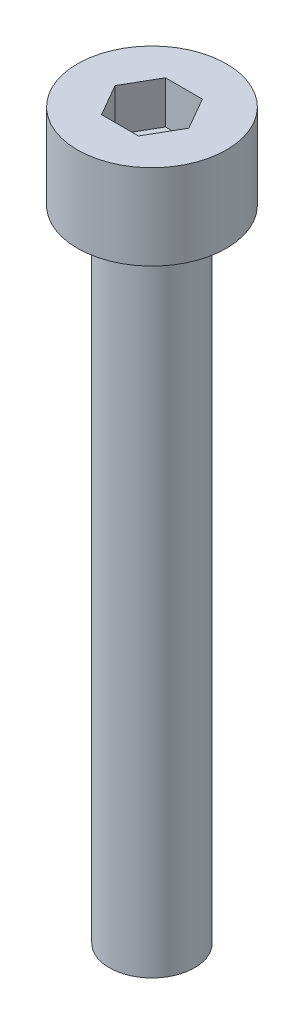
ISO-10303-21;
HEADER;
FILE_DESCRIPTION(('STEP AP214'),'2;1');
FILE_NAME('part.step','',(''),(''),'','','');
FILE_SCHEMA(('AUTOMOTIVE_DESIGN { 1 0 10303 214 1 1 1 1 }'));
ENDSEC;
DATA;
#1=APPLICATION_CONTEXT('core data for automotive mechanical design processes');
#2=APPLICATION_PROTOCOL_DEFINITION('international standard','automotive_design',2000,#1);
#3=PRODUCT_CONTEXT('',#1,'mechanical');
#4=PRODUCT('Part','Part','',(#3));
#5=PRODUCT_RELATED_PRODUCT_CATEGORY('part','',(#4));
#6=PRODUCT_DEFINITION_FORMATION('','',#4);
#7=PRODUCT_DEFINITION_CONTEXT('part definition',#1,'design');
#8=PRODUCT_DEFINITION('design','',#6,#7);
#9=PRODUCT_DEFINITION_SHAPE('','',#8);
#10=(LENGTH_UNIT() NAMED_UNIT(*) SI_UNIT(.MILLI.,.METRE.));
#11=(NAMED_UNIT(*) PLANE_ANGLE_UNIT() SI_UNIT($,.RADIAN.));
#12=(NAMED_UNIT(*) SI_UNIT($,.STERADIAN.) SOLID_ANGLE_UNIT());
#13=UNCERTAINTY_MEASURE_WITH_UNIT(LENGTH_MEASURE(1.E-05),#10,'distance_accuracy_value','');
#14=(GEOMETRIC_REPRESENTATION_CONTEXT(3) GLOBAL_UNCERTAINTY_ASSIGNED_CONTEXT((#13)) GLOBAL_UNIT_ASSIGNED_CONTEXT((#10,
#11,#12)) REPRESENTATION_CONTEXT('',''));
#15=CARTESIAN_POINT('',(0.,0.,0.));
#16=DIRECTION('',(0.,0.,1.));
#17=DIRECTION('',(1.,0.,0.));
#18=AXIS2_PLACEMENT_3D('',#15,#16,#17);
#19=CARTESIAN_POINT('',(0.,4.,0.));
#20=DIRECTION('',(0.,-1.,0.));
#21=DIRECTION('',(0.,0.,-1.));
#22=AXIS2_PLACEMENT_3D('',#19,#20,#21);
#23=CYLINDRICAL_SURFACE('',#22,3.5);
#24=CARTESIAN_POINT('',(0.,4.,0.));
#25=DIRECTION('',(0.,1.,0.));
#26=DIRECTION('',(0.,0.,1.));
#27=AXIS2_PLACEMENT_3D('',#24,#25,#26);
#28=CIRCLE('',#27,3.5);
#29=CARTESIAN_POINT('',(0.,4.,3.5));
#30=VERTEX_POINT('',#29);
#31=EDGE_CURVE('E43',#30,#30,#28,.T.);
#32=ORIENTED_EDGE('',*,*,#31,.F.);
#33=EDGE_LOOP('',(#32));
#34=FACE_BOUND('',#33,.T.);
#35=CARTESIAN_POINT('',(0.,0.,0.));
#36=DIRECTION('',(0.,1.,0.));
#37=DIRECTION('',(0.,0.,1.));
#38=AXIS2_PLACEMENT_3D('',#35,#36,#37);
#39=CIRCLE('',#38,3.5);
#40=CARTESIAN_POINT('',(0.,0.,3.5));
#41=VERTEX_POINT('',#40);
#42=EDGE_CURVE('E38',#41,#41,#39,.T.);
#43=ORIENTED_EDGE('',*,*,#42,.T.);
#44=EDGE_LOOP('',(#43));
#45=FACE_BOUND('',#44,.T.);
#46=ADVANCED_FACE('F35',(#34,#45),#23,.T.);
#47=CARTESIAN_POINT('',(0.,4.,0.));
#48=DIRECTION('',(0.,1.,0.));
#49=DIRECTION('',(0.,0.,1.));
#50=AXIS2_PLACEMENT_3D('',#47,#48,#49);
#51=PLANE('',#50);
#52=DIRECTION('',(0.5,0.,-0.866025403784439));
#53=VECTOR('',#52,1.);
#54=CARTESIAN_POINT('',(0.866025403784438,4.,1.5));
#55=LINE('',#54,#53);
#56=CARTESIAN_POINT('',(0.866025403784438,4.,1.5));
#57=VERTEX_POINT('',#56);
#58=CARTESIAN_POINT('',(1.73205080756888,4.,0.));
#59=VERTEX_POINT('',#58);
#60=EDGE_CURVE('E51',#57,#59,#55,.T.);
#61=ORIENTED_EDGE('',*,*,#60,.F.);
#62=DIRECTION('',(1.,0.,0.));
#63=VECTOR('',#62,1.);
#64=CARTESIAN_POINT('',(-0.866025403784439,4.,1.5));
#65=LINE('',#64,#63);
#66=CARTESIAN_POINT('',(-0.866025403784439,4.,1.5));
#67=VERTEX_POINT('',#66);
#68=EDGE_CURVE('E135',#67,#57,#65,.T.);
#69=ORIENTED_EDGE('',*,*,#68,.F.);
#70=DIRECTION('',(0.5,0.,0.866025403784438));
#71=VECTOR('',#70,1.);
#72=CARTESIAN_POINT('',(-1.73205080756888,4.,0.));
#73=LINE('',#72,#71);
#74=CARTESIAN_POINT('',(-1.73205080756888,4.,0.));
#75=VERTEX_POINT('',#74);
#76=EDGE_CURVE('E133',#75,#67,#73,.T.);
#77=ORIENTED_EDGE('',*,*,#76,.F.);
#78=DIRECTION('',(-0.5,0.,0.866025403784439));
#79=VECTOR('',#78,1.);
#80=CARTESIAN_POINT('',(-0.866025403784439,4.,-1.5));
#81=LINE('',#80,#79);
#82=CARTESIAN_POINT('',(-0.866025403784439,4.,-1.5));
#83=VERTEX_POINT('',#82);
#84=EDGE_CURVE('E99',#83,#75,#81,.T.);
#85=ORIENTED_EDGE('',*,*,#84,.F.);
#86=DIRECTION('',(-1.,0.,0.));
#87=VECTOR('',#86,1.);
#88=CARTESIAN_POINT('',(0.866025403784438,4.,-1.5));
#89=LINE('',#88,#87);
#90=CARTESIAN_POINT('',(0.866025403784438,4.,-1.5));
#91=VERTEX_POINT('',#90);
#92=EDGE_CURVE('E129',#91,#83,#89,.T.);
#93=ORIENTED_EDGE('',*,*,#92,.F.);
#94=DIRECTION('',(-0.5,0.,-0.866025403784439));
#95=VECTOR('',#94,1.);
#96=CARTESIAN_POINT('',(1.73205080756888,4.,0.));
#97=LINE('',#96,#95);
#98=EDGE_CURVE('E125',#59,#91,#97,.T.);
#99=ORIENTED_EDGE('',*,*,#98,.F.);
#100=EDGE_LOOP('',(#61,#69,#77,#85,#93,#99));
#101=FACE_BOUND('',#100,.T.);
#102=ORIENTED_EDGE('',*,*,#31,.T.);
#103=EDGE_LOOP('',(#102));
#104=FACE_BOUND('',#103,.T.);
#105=ADVANCED_FACE('F153',(#101,#104),#51,.T.);
#106=CARTESIAN_POINT('',(0.,0.,0.));
#107=DIRECTION('',(0.,1.,0.));
#108=DIRECTION('',(0.,0.,1.));
#109=AXIS2_PLACEMENT_3D('',#106,#107,#108);
#110=PLANE('',#109);
#111=CARTESIAN_POINT('',(0.,0.,0.));
#112=DIRECTION('',(0.,-1.,0.));
#113=DIRECTION('',(0.,0.,-1.));
#114=AXIS2_PLACEMENT_3D('',#111,#112,#113);
#115=CIRCLE('',#114,2.);
#116=CARTESIAN_POINT('',(0.,0.,-2.));
#117=VERTEX_POINT('',#116);
#118=EDGE_CURVE('E11',#117,#117,#115,.T.);
#119=ORIENTED_EDGE('',*,*,#118,.F.);
#120=EDGE_LOOP('',(#119));
#121=FACE_BOUND('',#120,.T.);
#122=ORIENTED_EDGE('',*,*,#42,.F.);
#123=EDGE_LOOP('',(#122));
#124=FACE_BOUND('',#123,.T.);
#125=ADVANCED_FACE('F150',(#121,#124),#110,.F.);
#126=CARTESIAN_POINT('',(0.866025403784438,2.,1.5));
#127=DIRECTION('',(0.866025403784439,0.,0.5));
#128=DIRECTION('',(0.5,0.,-0.866025403784439));
#129=AXIS2_PLACEMENT_3D('',#126,#127,#128);
#130=PLANE('',#129);
#131=ORIENTED_EDGE('',*,*,#60,.T.);
#132=DIRECTION('',(0.,1.,0.));
#133=VECTOR('',#132,1.);
#134=CARTESIAN_POINT('',(1.73205080756888,2.,0.));
#135=LINE('',#134,#133);
#136=CARTESIAN_POINT('',(1.73205080756888,2.,0.));
#137=VERTEX_POINT('',#136);
#138=EDGE_CURVE('E81',#137,#59,#135,.T.);
#139=ORIENTED_EDGE('',*,*,#138,.F.);
#140=DIRECTION('',(0.5,0.,-0.866025403784439));
#141=VECTOR('',#140,1.);
#142=CARTESIAN_POINT('',(0.866025403784438,2.,1.5));
#143=LINE('',#142,#141);
#144=CARTESIAN_POINT('',(0.866025403784438,2.,1.5));
#145=VERTEX_POINT('',#144);
#146=EDGE_CURVE('E137',#145,#137,#143,.T.);
#147=ORIENTED_EDGE('',*,*,#146,.F.);
#148=DIRECTION('',(0.,1.,0.));
#149=VECTOR('',#148,1.);
#150=CARTESIAN_POINT('',(0.866025403784438,2.,1.5));
#151=LINE('',#150,#149);
#152=EDGE_CURVE('E59',#145,#57,#151,.T.);
#153=ORIENTED_EDGE('',*,*,#152,.T.);
#154=EDGE_LOOP('',(#131,#139,#147,#153));
#155=FACE_BOUND('',#154,.T.);
#156=ADVANCED_FACE('F152',(#155),#130,.F.);
#157=CARTESIAN_POINT('',(-0.866025403784439,2.,1.5));
#158=DIRECTION('',(0.,0.,1.));
#159=DIRECTION('',(1.,0.,0.));
#160=AXIS2_PLACEMENT_3D('',#157,#158,#159);
#161=PLANE('',#160);
#162=ORIENTED_EDGE('',*,*,#68,.T.);
#163=ORIENTED_EDGE('',*,*,#152,.F.);
#164=DIRECTION('',(1.,0.,0.));
#165=VECTOR('',#164,1.);
#166=CARTESIAN_POINT('',(-0.866025403784439,2.,1.5));
#167=LINE('',#166,#165);
#168=CARTESIAN_POINT('',(-0.866025403784439,2.,1.5));
#169=VERTEX_POINT('',#168);
#170=EDGE_CURVE('E111',#169,#145,#167,.T.);
#171=ORIENTED_EDGE('',*,*,#170,.F.);
#172=DIRECTION('',(0.,1.,0.));
#173=VECTOR('',#172,1.);
#174=CARTESIAN_POINT('',(-0.866025403784439,2.,1.5));
#175=LINE('',#174,#173);
#176=EDGE_CURVE('E103',#169,#67,#175,.T.);
#177=ORIENTED_EDGE('',*,*,#176,.T.);
#178=EDGE_LOOP('',(#162,#163,#171,#177));
#179=FACE_BOUND('',#178,.T.);
#180=ADVANCED_FACE('F159',(#179),#161,.F.);
#181=CARTESIAN_POINT('',(-1.73205080756888,2.,0.));
#182=DIRECTION('',(-0.866025403784439,0.,0.5));
#183=DIRECTION('',(0.5,0.,0.866025403784438));
#184=AXIS2_PLACEMENT_3D('',#181,#182,#183);
#185=PLANE('',#184);
#186=ORIENTED_EDGE('',*,*,#76,.T.);
#187=ORIENTED_EDGE('',*,*,#176,.F.);
#188=DIRECTION('',(0.5,0.,0.866025403784438));
#189=VECTOR('',#188,1.);
#190=CARTESIAN_POINT('',(-1.73205080756888,2.,0.));
#191=LINE('',#190,#189);
#192=CARTESIAN_POINT('',(-1.73205080756888,2.,0.));
#193=VERTEX_POINT('',#192);
#194=EDGE_CURVE('E107',#193,#169,#191,.T.);
#195=ORIENTED_EDGE('',*,*,#194,.F.);
#196=DIRECTION('',(0.,1.,0.));
#197=VECTOR('',#196,1.);
#198=CARTESIAN_POINT('',(-1.73205080756888,2.,0.));
#199=LINE('',#198,#197);
#200=EDGE_CURVE('E92',#193,#75,#199,.T.);
#201=ORIENTED_EDGE('',*,*,#200,.T.);
#202=EDGE_LOOP('',(#186,#187,#195,#201));
#203=FACE_BOUND('',#202,.T.);
#204=ADVANCED_FACE('F108',(#203),#185,.F.);
#205=CARTESIAN_POINT('',(-0.866025403784439,2.,-1.5));
#206=DIRECTION('',(-0.866025403784439,0.,-0.5));
#207=DIRECTION('',(-0.5,0.,0.866025403784439));
#208=AXIS2_PLACEMENT_3D('',#205,#206,#207);
#209=PLANE('',#208);
#210=ORIENTED_EDGE('',*,*,#84,.T.);
#211=ORIENTED_EDGE('',*,*,#200,.F.);
#212=DIRECTION('',(-0.5,0.,0.866025403784439));
#213=VECTOR('',#212,1.);
#214=CARTESIAN_POINT('',(-0.866025403784439,2.,-1.5));
#215=LINE('',#214,#213);
#216=CARTESIAN_POINT('',(-0.866025403784439,2.,-1.5));
#217=VERTEX_POINT('',#216);
#218=EDGE_CURVE('E96',#217,#193,#215,.T.);
#219=ORIENTED_EDGE('',*,*,#218,.F.);
#220=DIRECTION('',(0.,1.,0.));
#221=VECTOR('',#220,1.);
#222=CARTESIAN_POINT('',(-0.866025403784439,2.,-1.5));
#223=LINE('',#222,#221);
#224=EDGE_CURVE('E104',#217,#83,#223,.T.);
#225=ORIENTED_EDGE('',*,*,#224,.T.);
#226=EDGE_LOOP('',(#210,#211,#219,#225));
#227=FACE_BOUND('',#226,.T.);
#228=ADVANCED_FACE('F94',(#227),#209,.F.);
#229=CARTESIAN_POINT('',(0.866025403784438,2.,-1.5));
#230=DIRECTION('',(0.,0.,-1.));
#231=DIRECTION('',(-1.,0.,0.));
#232=AXIS2_PLACEMENT_3D('',#229,#230,#231);
#233=PLANE('',#232);
#234=ORIENTED_EDGE('',*,*,#92,.T.);
#235=ORIENTED_EDGE('',*,*,#224,.F.);
#236=DIRECTION('',(-1.,0.,0.));
#237=VECTOR('',#236,1.);
#238=CARTESIAN_POINT('',(0.866025403784438,2.,-1.5));
#239=LINE('',#238,#237);
#240=CARTESIAN_POINT('',(0.866025403784438,2.,-1.5));
#241=VERTEX_POINT('',#240);
#242=EDGE_CURVE('E117',#241,#217,#239,.T.);
#243=ORIENTED_EDGE('',*,*,#242,.F.);
#244=DIRECTION('',(0.,1.,0.));
#245=VECTOR('',#244,1.);
#246=CARTESIAN_POINT('',(0.866025403784438,2.,-1.5));
#247=LINE('',#246,#245);
#248=EDGE_CURVE('E141',#241,#91,#247,.T.);
#249=ORIENTED_EDGE('',*,*,#248,.T.);
#250=EDGE_LOOP('',(#234,#235,#243,#249));
#251=FACE_BOUND('',#250,.T.);
#252=ADVANCED_FACE('F204',(#251),#233,.F.);
#253=CARTESIAN_POINT('',(1.73205080756888,2.,0.));
#254=DIRECTION('',(0.866025403784439,0.,-0.5));
#255=DIRECTION('',(-0.5,0.,-0.866025403784439));
#256=AXIS2_PLACEMENT_3D('',#253,#254,#255);
#257=PLANE('',#256);
#258=ORIENTED_EDGE('',*,*,#98,.T.);
#259=ORIENTED_EDGE('',*,*,#248,.F.);
#260=DIRECTION('',(-0.5,0.,-0.866025403784439));
#261=VECTOR('',#260,1.);
#262=CARTESIAN_POINT('',(1.73205080756888,2.,0.));
#263=LINE('',#262,#261);
#264=EDGE_CURVE('E119',#137,#241,#263,.T.);
#265=ORIENTED_EDGE('',*,*,#264,.F.);
#266=ORIENTED_EDGE('',*,*,#138,.T.);
#267=EDGE_LOOP('',(#258,#259,#265,#266));
#268=FACE_BOUND('',#267,.T.);
#269=ADVANCED_FACE('F213',(#268),#257,.F.);
#270=CARTESIAN_POINT('',(0.,2.,0.));
#271=DIRECTION('',(0.,1.,0.));
#272=DIRECTION('',(0.,0.,1.));
#273=AXIS2_PLACEMENT_3D('',#270,#271,#272);
#274=PLANE('',#273);
#275=ORIENTED_EDGE('',*,*,#146,.T.);
#276=ORIENTED_EDGE('',*,*,#264,.T.);
#277=ORIENTED_EDGE('',*,*,#242,.T.);
#278=ORIENTED_EDGE('',*,*,#218,.T.);
#279=ORIENTED_EDGE('',*,*,#194,.T.);
#280=ORIENTED_EDGE('',*,*,#170,.T.);
#281=EDGE_LOOP('',(#275,#276,#277,#278,#279,#280));
#282=FACE_BOUND('',#281,.T.);
#283=ADVANCED_FACE('F114',(#282),#274,.T.);
#284=CARTESIAN_POINT('',(0.,-30.,0.));
#285=DIRECTION('',(0.,1.,0.));
#286=DIRECTION('',(0.,0.,1.));
#287=AXIS2_PLACEMENT_3D('',#284,#285,#286);
#288=CYLINDRICAL_SURFACE('',#287,2.);
#289=CARTESIAN_POINT('',(0.,-30.,0.));
#290=DIRECTION('',(0.,-1.,0.));
#291=DIRECTION('',(0.,0.,-1.));
#292=AXIS2_PLACEMENT_3D('',#289,#290,#291);
#293=CIRCLE('',#292,2.);
#294=CARTESIAN_POINT('',(0.,-30.,-2.));
#295=VERTEX_POINT('',#294);
#296=EDGE_CURVE('E126',#295,#295,#293,.T.);
#297=ORIENTED_EDGE('',*,*,#296,.F.);
#298=EDGE_LOOP('',(#297));
#299=FACE_BOUND('',#298,.T.);
#300=ORIENTED_EDGE('',*,*,#118,.T.);
#301=EDGE_LOOP('',(#300));
#302=FACE_BOUND('',#301,.T.);
#303=ADVANCED_FACE('F231',(#299,#302),#288,.T.);
#304=CARTESIAN_POINT('',(0.,-30.,0.));
#305=DIRECTION('',(0.,-1.,0.));
#306=DIRECTION('',(0.,0.,-1.));
#307=AXIS2_PLACEMENT_3D('',#304,#305,#306);
#308=PLANE('',#307);
#309=ORIENTED_EDGE('',*,*,#296,.T.);
#310=EDGE_LOOP('',(#309));
#311=FACE_BOUND('',#310,.T.);
#312=ADVANCED_FACE('F244',(#311),#308,.T.);
#313=CLOSED_SHELL('',(#46,#105,#125,#156,#180,#204,#228,#252,#269,#283,#303,#312));
#314=MANIFOLD_SOLID_BREP('B2',#313);
#315=ADVANCED_BREP_SHAPE_REPRESENTATION('',(#18,#314),#14);
#316=SHAPE_DEFINITION_REPRESENTATION(#9,#315);
ENDSEC;
END-ISO-10303-21;
